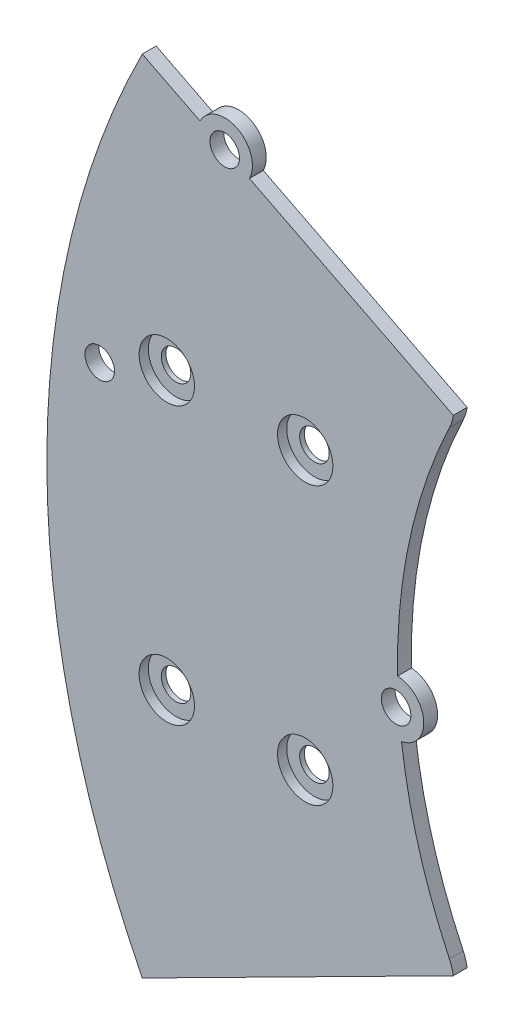
ISO-10303-21;
HEADER;
FILE_DESCRIPTION(('STEP AP214'),'2;1');
FILE_NAME('part.step','',(''),(''),'','','');
FILE_SCHEMA(('AUTOMOTIVE_DESIGN { 1 0 10303 214 1 1 1 1 }'));
ENDSEC;
DATA;
#1=APPLICATION_CONTEXT('core data for automotive mechanical design processes');
#2=APPLICATION_PROTOCOL_DEFINITION('international standard','automotive_design',2000,#1);
#3=PRODUCT_CONTEXT('',#1,'mechanical');
#4=PRODUCT('Part','Part','',(#3));
#5=PRODUCT_RELATED_PRODUCT_CATEGORY('part','',(#4));
#6=PRODUCT_DEFINITION_FORMATION('','',#4);
#7=PRODUCT_DEFINITION_CONTEXT('part definition',#1,'design');
#8=PRODUCT_DEFINITION('design','',#6,#7);
#9=PRODUCT_DEFINITION_SHAPE('','',#8);
#10=(LENGTH_UNIT() NAMED_UNIT(*) SI_UNIT(.MILLI.,.METRE.));
#11=(NAMED_UNIT(*) PLANE_ANGLE_UNIT() SI_UNIT($,.RADIAN.));
#12=(NAMED_UNIT(*) SI_UNIT($,.STERADIAN.) SOLID_ANGLE_UNIT());
#13=UNCERTAINTY_MEASURE_WITH_UNIT(LENGTH_MEASURE(1.E-05),#10,'distance_accuracy_value','');
#14=(GEOMETRIC_REPRESENTATION_CONTEXT(3) GLOBAL_UNCERTAINTY_ASSIGNED_CONTEXT((#13)) GLOBAL_UNIT_ASSIGNED_CONTEXT((#10,
#11,#12)) REPRESENTATION_CONTEXT('',''));
#15=CARTESIAN_POINT('',(0.,0.,0.));
#16=DIRECTION('',(0.,0.,1.));
#17=DIRECTION('',(1.,0.,0.));
#18=AXIS2_PLACEMENT_3D('',#15,#16,#17);
#19=CARTESIAN_POINT('',(0.,15.,1.5));
#20=DIRECTION('',(0.,0.,-1.));
#21=DIRECTION('',(-1.,0.,0.));
#22=AXIS2_PLACEMENT_3D('',#19,#20,#21);
#23=CYLINDRICAL_SURFACE('',#22,1.6);
#24=CARTESIAN_POINT('',(0.,15.,0.));
#25=DIRECTION('',(0.,0.,1.));
#26=DIRECTION('',(1.,0.,0.));
#27=AXIS2_PLACEMENT_3D('',#24,#25,#26);
#28=CIRCLE('',#27,1.6);
#29=CARTESIAN_POINT('',(1.6,15.,0.));
#30=VERTEX_POINT('',#29);
#31=EDGE_CURVE('E126',#30,#30,#28,.T.);
#32=ORIENTED_EDGE('',*,*,#31,.F.);
#33=EDGE_LOOP('',(#32));
#34=FACE_BOUND('',#33,.T.);
#35=CARTESIAN_POINT('',(0.,15.,0.5));
#36=DIRECTION('',(0.,0.,1.));
#37=DIRECTION('',(1.,0.,0.));
#38=AXIS2_PLACEMENT_3D('',#35,#36,#37);
#39=CIRCLE('',#38,1.6);
#40=CARTESIAN_POINT('',(1.6,15.,0.5));
#41=VERTEX_POINT('',#40);
#42=EDGE_CURVE('E41',#41,#41,#39,.T.);
#43=ORIENTED_EDGE('',*,*,#42,.T.);
#44=EDGE_LOOP('',(#43));
#45=FACE_BOUND('',#44,.T.);
#46=ADVANCED_FACE('F37',(#34,#45),#23,.F.);
#47=CARTESIAN_POINT('',(15.,15.,1.5));
#48=DIRECTION('',(0.,0.,-1.));
#49=DIRECTION('',(-1.,0.,0.));
#50=AXIS2_PLACEMENT_3D('',#47,#48,#49);
#51=CYLINDRICAL_SURFACE('',#50,1.6);
#52=CARTESIAN_POINT('',(15.,15.,0.));
#53=DIRECTION('',(0.,0.,1.));
#54=DIRECTION('',(1.,0.,0.));
#55=AXIS2_PLACEMENT_3D('',#52,#53,#54);
#56=CIRCLE('',#55,1.6);
#57=CARTESIAN_POINT('',(16.6,15.,0.));
#58=VERTEX_POINT('',#57);
#59=EDGE_CURVE('E192',#58,#58,#56,.T.);
#60=ORIENTED_EDGE('',*,*,#59,.F.);
#61=EDGE_LOOP('',(#60));
#62=FACE_BOUND('',#61,.T.);
#63=CARTESIAN_POINT('',(15.,15.,0.5));
#64=DIRECTION('',(0.,0.,1.));
#65=DIRECTION('',(1.,0.,0.));
#66=AXIS2_PLACEMENT_3D('',#63,#64,#65);
#67=CIRCLE('',#66,1.6);
#68=CARTESIAN_POINT('',(16.6,15.,0.5));
#69=VERTEX_POINT('',#68);
#70=EDGE_CURVE('E233',#69,#69,#67,.T.);
#71=ORIENTED_EDGE('',*,*,#70,.T.);
#72=EDGE_LOOP('',(#71));
#73=FACE_BOUND('',#72,.T.);
#74=ADVANCED_FACE('F312',(#62,#73),#51,.F.);
#75=CARTESIAN_POINT('',(15.,-15.,1.5));
#76=DIRECTION('',(0.,0.,-1.));
#77=DIRECTION('',(-1.,0.,0.));
#78=AXIS2_PLACEMENT_3D('',#75,#76,#77);
#79=CYLINDRICAL_SURFACE('',#78,1.6);
#80=CARTESIAN_POINT('',(15.,-15.,0.));
#81=DIRECTION('',(0.,0.,1.));
#82=DIRECTION('',(1.,0.,0.));
#83=AXIS2_PLACEMENT_3D('',#80,#81,#82);
#84=CIRCLE('',#83,1.6);
#85=CARTESIAN_POINT('',(16.6,-15.,0.));
#86=VERTEX_POINT('',#85);
#87=EDGE_CURVE('E189',#86,#86,#84,.T.);
#88=ORIENTED_EDGE('',*,*,#87,.F.);
#89=EDGE_LOOP('',(#88));
#90=FACE_BOUND('',#89,.T.);
#91=CARTESIAN_POINT('',(15.,-15.,0.5));
#92=DIRECTION('',(0.,0.,1.));
#93=DIRECTION('',(1.,0.,0.));
#94=AXIS2_PLACEMENT_3D('',#91,#92,#93);
#95=CIRCLE('',#94,1.6);
#96=CARTESIAN_POINT('',(16.6,-15.,0.5));
#97=VERTEX_POINT('',#96);
#98=EDGE_CURVE('E230',#97,#97,#95,.T.);
#99=ORIENTED_EDGE('',*,*,#98,.T.);
#100=EDGE_LOOP('',(#99));
#101=FACE_BOUND('',#100,.T.);
#102=ADVANCED_FACE('F319',(#90,#101),#79,.F.);
#103=CARTESIAN_POINT('',(0.,-15.,1.5));
#104=DIRECTION('',(0.,0.,-1.));
#105=DIRECTION('',(-1.,0.,0.));
#106=AXIS2_PLACEMENT_3D('',#103,#104,#105);
#107=CYLINDRICAL_SURFACE('',#106,1.6);
#108=CARTESIAN_POINT('',(0.,-15.,0.));
#109=DIRECTION('',(0.,0.,1.));
#110=DIRECTION('',(1.,0.,0.));
#111=AXIS2_PLACEMENT_3D('',#108,#109,#110);
#112=CIRCLE('',#111,1.6);
#113=CARTESIAN_POINT('',(1.6,-15.,0.));
#114=VERTEX_POINT('',#113);
#115=EDGE_CURVE('E186',#114,#114,#112,.T.);
#116=ORIENTED_EDGE('',*,*,#115,.F.);
#117=EDGE_LOOP('',(#116));
#118=FACE_BOUND('',#117,.T.);
#119=CARTESIAN_POINT('',(0.,-15.,0.5));
#120=DIRECTION('',(0.,0.,1.));
#121=DIRECTION('',(1.,0.,0.));
#122=AXIS2_PLACEMENT_3D('',#119,#120,#121);
#123=CIRCLE('',#122,1.6);
#124=CARTESIAN_POINT('',(1.6,-15.,0.5));
#125=VERTEX_POINT('',#124);
#126=EDGE_CURVE('E227',#125,#125,#123,.T.);
#127=ORIENTED_EDGE('',*,*,#126,.T.);
#128=EDGE_LOOP('',(#127));
#129=FACE_BOUND('',#128,.T.);
#130=ADVANCED_FACE('F364',(#118,#129),#107,.F.);
#131=CARTESIAN_POINT('',(83.,0.,1.5));
#132=DIRECTION('',(0.,0.,-1.));
#133=DIRECTION('',(-1.,0.,0.));
#134=AXIS2_PLACEMENT_3D('',#131,#132,#133);
#135=CYLINDRICAL_SURFACE('',#134,58.);
#136=CARTESIAN_POINT('',(83.,0.,1.5));
#137=DIRECTION('',(0.,0.,-1.));
#138=DIRECTION('',(1.,0.,0.));
#139=AXIS2_PLACEMENT_3D('',#136,#137,#138);
#140=CIRCLE('',#139,58.);
#141=CARTESIAN_POINT('',(25.012228271291,-1.19093658065189,1.5));
#142=VERTEX_POINT('',#141);
#143=CARTESIAN_POINT('',(30.6273822748281,24.9220567492535,1.5));
#144=VERTEX_POINT('',#143);
#145=EDGE_CURVE('E54',#142,#144,#140,.T.);
#146=ORIENTED_EDGE('',*,*,#145,.F.);
#147=DIRECTION('',(0.,0.,1.));
#148=VECTOR('',#147,1.);
#149=CARTESIAN_POINT('',(25.012228271291,-1.19093658065185,0.749999999999999));
#150=LINE('',#149,#148);
#151=CARTESIAN_POINT('',(25.012228271291,-1.19093658065185,0.));
#152=VERTEX_POINT('',#151);
#153=EDGE_CURVE('E128',#142,#152,#150,.F.);
#154=ORIENTED_EDGE('',*,*,#153,.T.);
#155=CARTESIAN_POINT('',(83.,0.,0.));
#156=DIRECTION('',(0.,0.,-1.));
#157=DIRECTION('',(1.,0.,0.));
#158=AXIS2_PLACEMENT_3D('',#155,#156,#157);
#159=CIRCLE('',#158,58.);
#160=CARTESIAN_POINT('',(30.6273822748281,24.9220567492535,0.));
#161=VERTEX_POINT('',#160);
#162=EDGE_CURVE('E116',#152,#161,#159,.T.);
#163=ORIENTED_EDGE('',*,*,#162,.T.);
#164=DIRECTION('',(0.,0.,-1.));
#165=VECTOR('',#164,1.);
#166=CARTESIAN_POINT('',(30.6273822748281,24.9220567492535,1.5));
#167=LINE('',#166,#165);
#168=EDGE_CURVE('E212',#161,#144,#167,.F.);
#169=ORIENTED_EDGE('',*,*,#168,.T.);
#170=EDGE_LOOP('',(#146,#154,#163,#169));
#171=FACE_BOUND('',#170,.T.);
#172=ADVANCED_FACE('F129',(#171),#135,.F.);
#173=CARTESIAN_POINT('',(83.,0.,0.));
#174=DIRECTION('',(-0.451660876345928,-0.892189695512354,0.));
#175=DIRECTION('',(0.892189695512355,-0.451660876345929,0.));
#176=AXIS2_PLACEMENT_3D('',#173,#174,#175);
#177=PLANE('',#176);
#178=DIRECTION('',(0.892189695512354,-0.451660876345929,0.));
#179=VECTOR('',#178,1.);
#180=CARTESIAN_POINT('',(83.,0.,0.));
#181=LINE('',#180,#179);
#182=CARTESIAN_POINT('',(8.95576539103195,37.4840508246903,0.));
#183=VERTEX_POINT('',#182);
#184=CARTESIAN_POINT('',(31.0524419154815,26.2978598906714,0.));
#185=VERTEX_POINT('',#184);
#186=EDGE_CURVE('E172',#183,#185,#181,.T.);
#187=ORIENTED_EDGE('',*,*,#186,.F.);
#188=DIRECTION('',(0.,0.,1.));
#189=VECTOR('',#188,1.);
#190=CARTESIAN_POINT('',(8.95576539103195,37.4840508246903,-8.48528137423857));
#191=LINE('',#190,#189);
#192=CARTESIAN_POINT('',(8.95576539103195,37.4840508246903,1.5));
#193=VERTEX_POINT('',#192);
#194=EDGE_CURVE('E145',#183,#193,#191,.T.);
#195=ORIENTED_EDGE('',*,*,#194,.T.);
#196=DIRECTION('',(0.892189695512354,-0.451660876345929,0.));
#197=VECTOR('',#196,1.);
#198=CARTESIAN_POINT('',(83.,0.,1.5));
#199=LINE('',#198,#197);
#200=CARTESIAN_POINT('',(31.0524419154815,26.2978598906714,1.5));
#201=VERTEX_POINT('',#200);
#202=EDGE_CURVE('E179',#193,#201,#199,.T.);
#203=ORIENTED_EDGE('',*,*,#202,.T.);
#204=DIRECTION('',(0.,0.,-1.));
#205=VECTOR('',#204,1.);
#206=CARTESIAN_POINT('',(31.0524419154815,26.2978598906714,1.5));
#207=LINE('',#206,#205);
#208=EDGE_CURVE('E183',#201,#185,#207,.T.);
#209=ORIENTED_EDGE('',*,*,#208,.T.);
#210=EDGE_LOOP('',(#187,#195,#203,#209));
#211=FACE_BOUND('',#210,.T.);
#212=ADVANCED_FACE('F282',(#211),#177,.F.);
#213=CARTESIAN_POINT('',(83.,0.,1.5));
#214=DIRECTION('',(0.,0.,1.));
#215=DIRECTION('',(1.,0.,0.));
#216=AXIS2_PLACEMENT_3D('',#213,#214,#215);
#217=PLANE('',#216);
#218=CARTESIAN_POINT('',(0.,-15.,1.5));
#219=DIRECTION('',(0.,0.,1.));
#220=DIRECTION('',(1.,0.,0.));
#221=AXIS2_PLACEMENT_3D('',#218,#219,#220);
#222=CIRCLE('',#221,3.);
#223=CARTESIAN_POINT('',(3.,-15.,1.5));
#224=VERTEX_POINT('',#223);
#225=EDGE_CURVE('E252',#224,#224,#222,.T.);
#226=ORIENTED_EDGE('',*,*,#225,.F.);
#227=EDGE_LOOP('',(#226));
#228=FACE_BOUND('',#227,.T.);
#229=CARTESIAN_POINT('',(15.,-15.,1.5));
#230=DIRECTION('',(0.,0.,1.));
#231=DIRECTION('',(1.,0.,0.));
#232=AXIS2_PLACEMENT_3D('',#229,#230,#231);
#233=CIRCLE('',#232,3.);
#234=CARTESIAN_POINT('',(18.,-15.,1.5));
#235=VERTEX_POINT('',#234);
#236=EDGE_CURVE('E258',#235,#235,#233,.T.);
#237=ORIENTED_EDGE('',*,*,#236,.F.);
#238=EDGE_LOOP('',(#237));
#239=FACE_BOUND('',#238,.T.);
#240=CARTESIAN_POINT('',(15.,15.,1.5));
#241=DIRECTION('',(0.,0.,1.));
#242=DIRECTION('',(1.,0.,0.));
#243=AXIS2_PLACEMENT_3D('',#240,#241,#242);
#244=CIRCLE('',#243,3.);
#245=CARTESIAN_POINT('',(18.,15.,1.5));
#246=VERTEX_POINT('',#245);
#247=EDGE_CURVE('E264',#246,#246,#244,.T.);
#248=ORIENTED_EDGE('',*,*,#247,.F.);
#249=EDGE_LOOP('',(#248));
#250=FACE_BOUND('',#249,.T.);
#251=CARTESIAN_POINT('',(0.,15.,1.5));
#252=DIRECTION('',(0.,0.,1.));
#253=DIRECTION('',(1.,0.,0.));
#254=AXIS2_PLACEMENT_3D('',#251,#252,#253);
#255=CIRCLE('',#254,3.);
#256=CARTESIAN_POINT('',(3.,15.,1.5));
#257=VERTEX_POINT('',#256);
#258=EDGE_CURVE('E140',#257,#257,#255,.T.);
#259=ORIENTED_EDGE('',*,*,#258,.F.);
#260=EDGE_LOOP('',(#259));
#261=FACE_BOUND('',#260,.T.);
#262=CARTESIAN_POINT('',(24.8481990525618,-4.18644896009598,1.5));
#263=DIRECTION('',(0.,0.,1.));
#264=DIRECTION('',(1.,0.,0.));
#265=AXIS2_PLACEMENT_3D('',#262,#263,#264);
#266=CIRCLE('',#265,3.);
#267=CARTESIAN_POINT('',(25.4396171896257,-7.12757537477996,1.5));
#268=VERTEX_POINT('',#267);
#269=EDGE_CURVE('E136',#268,#142,#266,.T.);
#270=ORIENTED_EDGE('',*,*,#269,.T.);
#271=ORIENTED_EDGE('',*,*,#145,.T.);
#272=CARTESIAN_POINT('',(26.1125014364512,27.0705099172926,1.5));
#273=DIRECTION('',(0.,0.,1.));
#274=DIRECTION('',(1.,0.,0.));
#275=AXIS2_PLACEMENT_3D('',#272,#273,#274);
#276=CIRCLE('',#275,5.);
#277=EDGE_CURVE('E216',#144,#201,#276,.T.);
#278=ORIENTED_EDGE('',*,*,#277,.T.);
#279=ORIENTED_EDGE('',*,*,#202,.F.);
#280=CARTESIAN_POINT('',(6.27919630449489,38.8390334537281,1.5));
#281=DIRECTION('',(0.,0.,1.));
#282=DIRECTION('',(1.,0.,0.));
#283=AXIS2_PLACEMENT_3D('',#280,#281,#282);
#284=CIRCLE('',#283,3.);
#285=CARTESIAN_POINT('',(3.60262721795782,40.1940160827658,1.5));
#286=VERTEX_POINT('',#285);
#287=EDGE_CURVE('E133',#193,#286,#284,.T.);
#288=ORIENTED_EDGE('',*,*,#287,.T.);
#289=CARTESIAN_POINT('',(-2.65021076918602,43.3594441292091,1.5));
#290=VERTEX_POINT('',#289);
#291=EDGE_CURVE('E173',#290,#286,#199,.T.);
#292=ORIENTED_EDGE('',*,*,#291,.F.);
#293=CARTESIAN_POINT('',(83.,0.,1.5));
#294=DIRECTION('',(0.,0.,1.));
#295=DIRECTION('',(1.,0.,0.));
#296=AXIS2_PLACEMENT_3D('',#293,#294,#295);
#297=CIRCLE('',#296,96.);
#298=CARTESIAN_POINT('',(-2.65021076918602,-43.3594441292091,1.5));
#299=VERTEX_POINT('',#298);
#300=EDGE_CURVE('E199',#290,#299,#297,.T.);
#301=ORIENTED_EDGE('',*,*,#300,.T.);
#302=DIRECTION('',(-0.892189695512354,-0.451660876345929,0.));
#303=VECTOR('',#302,1.);
#304=CARTESIAN_POINT('',(83.,0.,1.5));
#305=LINE('',#304,#303);
#306=CARTESIAN_POINT('',(31.0524419154815,-26.2978598906714,1.5));
#307=VERTEX_POINT('',#306);
#308=EDGE_CURVE('E154',#307,#299,#305,.T.);
#309=ORIENTED_EDGE('',*,*,#308,.F.);
#310=CARTESIAN_POINT('',(26.1125014364512,-27.0705099172926,1.5));
#311=DIRECTION('',(0.,0.,1.));
#312=DIRECTION('',(1.,0.,0.));
#313=AXIS2_PLACEMENT_3D('',#310,#311,#312);
#314=CIRCLE('',#313,5.);
#315=CARTESIAN_POINT('',(30.6273822748281,-24.9220567492535,1.5));
#316=VERTEX_POINT('',#315);
#317=EDGE_CURVE('E214',#307,#316,#314,.T.);
#318=ORIENTED_EDGE('',*,*,#317,.T.);
#319=EDGE_CURVE('E197',#316,#268,#140,.T.);
#320=ORIENTED_EDGE('',*,*,#319,.T.);
#321=EDGE_LOOP('',(#270,#271,#278,#279,#288,#292,#301,#309,#318,#320));
#322=FACE_BOUND('',#321,.T.);
#323=CARTESIAN_POINT('',(24.8481990525618,-4.18644896009598,1.5));
#324=DIRECTION('',(0.,0.,1.));
#325=DIRECTION('',(1.,0.,0.));
#326=AXIS2_PLACEMENT_3D('',#323,#324,#325);
#327=CIRCLE('',#326,1.6);
#328=CARTESIAN_POINT('',(26.4481990525618,-4.18644896009598,1.5));
#329=VERTEX_POINT('',#328);
#330=EDGE_CURVE('E150',#329,#329,#327,.T.);
#331=ORIENTED_EDGE('',*,*,#330,.F.);
#332=EDGE_LOOP('',(#331));
#333=FACE_BOUND('',#332,.T.);
#334=CARTESIAN_POINT('',(6.27919630449489,38.8390334537281,1.5));
#335=DIRECTION('',(0.,0.,1.));
#336=DIRECTION('',(1.,0.,0.));
#337=AXIS2_PLACEMENT_3D('',#334,#335,#336);
#338=CIRCLE('',#337,1.6);
#339=CARTESIAN_POINT('',(7.87919630449489,38.8390334537281,1.5));
#340=VERTEX_POINT('',#339);
#341=EDGE_CURVE('E161',#340,#340,#338,.T.);
#342=ORIENTED_EDGE('',*,*,#341,.F.);
#343=EDGE_LOOP('',(#342));
#344=FACE_BOUND('',#343,.T.);
#345=CARTESIAN_POINT('',(-7.27062998588297,12.0733425883574,1.5));
#346=DIRECTION('',(0.,0.,1.));
#347=DIRECTION('',(1.,0.,0.));
#348=AXIS2_PLACEMENT_3D('',#345,#346,#347);
#349=CIRCLE('',#348,1.6);
#350=CARTESIAN_POINT('',(-5.67062998588297,12.0733425883574,1.5));
#351=VERTEX_POINT('',#350);
#352=EDGE_CURVE('E155',#351,#351,#349,.T.);
#353=ORIENTED_EDGE('',*,*,#352,.F.);
#354=EDGE_LOOP('',(#353));
#355=FACE_BOUND('',#354,.T.);
#356=ADVANCED_FACE('F279',(#228,#239,#250,#261,#322,#333,#344,#355),#217,.T.);
#357=CARTESIAN_POINT('',(83.,0.,0.));
#358=DIRECTION('',(0.,0.,1.));
#359=DIRECTION('',(1.,0.,0.));
#360=AXIS2_PLACEMENT_3D('',#357,#358,#359);
#361=PLANE('',#360);
#362=ORIENTED_EDGE('',*,*,#162,.F.);
#363=CARTESIAN_POINT('',(24.8481990525618,-4.18644896009598,0.));
#364=DIRECTION('',(0.,0.,1.));
#365=DIRECTION('',(1.,0.,0.));
#366=AXIS2_PLACEMENT_3D('',#363,#364,#365);
#367=CIRCLE('',#366,3.);
#368=CARTESIAN_POINT('',(25.4396171896257,-7.12757537477996,0.));
#369=VERTEX_POINT('',#368);
#370=EDGE_CURVE('E121',#152,#369,#367,.F.);
#371=ORIENTED_EDGE('',*,*,#370,.T.);
#372=CARTESIAN_POINT('',(30.6273822748281,-24.9220567492535,0.));
#373=VERTEX_POINT('',#372);
#374=EDGE_CURVE('E125',#373,#369,#159,.T.);
#375=ORIENTED_EDGE('',*,*,#374,.F.);
#376=CARTESIAN_POINT('',(26.1125014364512,-27.0705099172926,0.));
#377=DIRECTION('',(0.,0.,1.));
#378=DIRECTION('',(1.,0.,0.));
#379=AXIS2_PLACEMENT_3D('',#376,#377,#378);
#380=CIRCLE('',#379,5.);
#381=CARTESIAN_POINT('',(31.0524419154815,-26.2978598906714,0.));
#382=VERTEX_POINT('',#381);
#383=EDGE_CURVE('E201',#373,#382,#380,.F.);
#384=ORIENTED_EDGE('',*,*,#383,.T.);
#385=DIRECTION('',(-0.892189695512354,-0.451660876345929,0.));
#386=VECTOR('',#385,1.);
#387=CARTESIAN_POINT('',(83.,0.,0.));
#388=LINE('',#387,#386);
#389=CARTESIAN_POINT('',(-2.65021076918602,-43.3594441292091,0.));
#390=VERTEX_POINT('',#389);
#391=EDGE_CURVE('E169',#382,#390,#388,.T.);
#392=ORIENTED_EDGE('',*,*,#391,.T.);
#393=CARTESIAN_POINT('',(83.,0.,0.));
#394=DIRECTION('',(0.,0.,1.));
#395=DIRECTION('',(1.,0.,0.));
#396=AXIS2_PLACEMENT_3D('',#393,#394,#395);
#397=CIRCLE('',#396,96.);
#398=CARTESIAN_POINT('',(-2.65021076918602,43.3594441292091,0.));
#399=VERTEX_POINT('',#398);
#400=EDGE_CURVE('E203',#399,#390,#397,.T.);
#401=ORIENTED_EDGE('',*,*,#400,.F.);
#402=CARTESIAN_POINT('',(3.60262721795782,40.1940160827658,0.));
#403=VERTEX_POINT('',#402);
#404=EDGE_CURVE('E174',#399,#403,#181,.T.);
#405=ORIENTED_EDGE('',*,*,#404,.T.);
#406=CARTESIAN_POINT('',(6.27919630449489,38.8390334537281,0.));
#407=DIRECTION('',(0.,0.,1.));
#408=DIRECTION('',(1.,0.,0.));
#409=AXIS2_PLACEMENT_3D('',#406,#407,#408);
#410=CIRCLE('',#409,3.);
#411=EDGE_CURVE('E143',#403,#183,#410,.F.);
#412=ORIENTED_EDGE('',*,*,#411,.T.);
#413=ORIENTED_EDGE('',*,*,#186,.T.);
#414=CARTESIAN_POINT('',(26.1125014364512,27.0705099172926,0.));
#415=DIRECTION('',(0.,0.,1.));
#416=DIRECTION('',(1.,0.,0.));
#417=AXIS2_PLACEMENT_3D('',#414,#415,#416);
#418=CIRCLE('',#417,5.);
#419=EDGE_CURVE('E123',#185,#161,#418,.F.);
#420=ORIENTED_EDGE('',*,*,#419,.T.);
#421=EDGE_LOOP('',(#362,#371,#375,#384,#392,#401,#405,#412,#413,#420));
#422=FACE_BOUND('',#421,.T.);
#423=CARTESIAN_POINT('',(24.8481990525618,-4.18644896009598,0.));
#424=DIRECTION('',(0.,0.,1.));
#425=DIRECTION('',(1.,0.,0.));
#426=AXIS2_PLACEMENT_3D('',#423,#424,#425);
#427=CIRCLE('',#426,1.6);
#428=CARTESIAN_POINT('',(26.4481990525618,-4.18644896009598,0.));
#429=VERTEX_POINT('',#428);
#430=EDGE_CURVE('E164',#429,#429,#427,.T.);
#431=ORIENTED_EDGE('',*,*,#430,.T.);
#432=EDGE_LOOP('',(#431));
#433=FACE_BOUND('',#432,.T.);
#434=CARTESIAN_POINT('',(-7.27062998588297,12.0733425883574,0.));
#435=DIRECTION('',(0.,0.,1.));
#436=DIRECTION('',(1.,0.,0.));
#437=AXIS2_PLACEMENT_3D('',#434,#435,#436);
#438=CIRCLE('',#437,1.6);
#439=CARTESIAN_POINT('',(-5.67062998588297,12.0733425883574,0.));
#440=VERTEX_POINT('',#439);
#441=EDGE_CURVE('E151',#440,#440,#438,.T.);
#442=ORIENTED_EDGE('',*,*,#441,.T.);
#443=EDGE_LOOP('',(#442));
#444=FACE_BOUND('',#443,.T.);
#445=CARTESIAN_POINT('',(6.27919630449489,38.8390334537281,0.));
#446=DIRECTION('',(0.,0.,1.));
#447=DIRECTION('',(1.,0.,0.));
#448=AXIS2_PLACEMENT_3D('',#445,#446,#447);
#449=CIRCLE('',#448,1.6);
#450=CARTESIAN_POINT('',(7.87919630449489,38.8390334537281,0.));
#451=VERTEX_POINT('',#450);
#452=EDGE_CURVE('E158',#451,#451,#449,.T.);
#453=ORIENTED_EDGE('',*,*,#452,.T.);
#454=EDGE_LOOP('',(#453));
#455=FACE_BOUND('',#454,.T.);
#456=ORIENTED_EDGE('',*,*,#31,.T.);
#457=EDGE_LOOP('',(#456));
#458=FACE_BOUND('',#457,.T.);
#459=ORIENTED_EDGE('',*,*,#59,.T.);
#460=EDGE_LOOP('',(#459));
#461=FACE_BOUND('',#460,.T.);
#462=ORIENTED_EDGE('',*,*,#87,.T.);
#463=EDGE_LOOP('',(#462));
#464=FACE_BOUND('',#463,.T.);
#465=ORIENTED_EDGE('',*,*,#115,.T.);
#466=EDGE_LOOP('',(#465));
#467=FACE_BOUND('',#466,.T.);
#468=ADVANCED_FACE('F117',(#422,#433,#444,#455,#458,#461,#464,#467),#361,.F.);
#469=ORIENTED_EDGE('',*,*,#374,.T.);
#470=DIRECTION('',(0.,0.,1.));
#471=VECTOR('',#470,1.);
#472=CARTESIAN_POINT('',(25.4396171896257,-7.12757537477996,0.749999999999999));
#473=LINE('',#472,#471);
#474=EDGE_CURVE('E11',#369,#268,#473,.T.);
#475=ORIENTED_EDGE('',*,*,#474,.T.);
#476=ORIENTED_EDGE('',*,*,#319,.F.);
#477=DIRECTION('',(0.,0.,-1.));
#478=VECTOR('',#477,1.);
#479=CARTESIAN_POINT('',(30.6273822748281,-24.9220567492535,1.5));
#480=LINE('',#479,#478);
#481=EDGE_CURVE('E209',#316,#373,#480,.T.);
#482=ORIENTED_EDGE('',*,*,#481,.T.);
#483=EDGE_LOOP('',(#469,#475,#476,#482));
#484=FACE_BOUND('',#483,.T.);
#485=ADVANCED_FACE('F327',(#484),#135,.F.);
#486=CARTESIAN_POINT('',(83.,0.,1.5));
#487=DIRECTION('',(0.,0.,-1.));
#488=DIRECTION('',(-1.,0.,0.));
#489=AXIS2_PLACEMENT_3D('',#486,#487,#488);
#490=CYLINDRICAL_SURFACE('',#489,96.);
#491=ORIENTED_EDGE('',*,*,#300,.F.);
#492=DIRECTION('',(0.,0.,-1.));
#493=VECTOR('',#492,1.);
#494=CARTESIAN_POINT('',(-2.65021076918602,43.3594441292091,1.5));
#495=LINE('',#494,#493);
#496=EDGE_CURVE('E222',#290,#399,#495,.T.);
#497=ORIENTED_EDGE('',*,*,#496,.T.);
#498=ORIENTED_EDGE('',*,*,#400,.T.);
#499=DIRECTION('',(0.,0.,-1.));
#500=VECTOR('',#499,1.);
#501=CARTESIAN_POINT('',(-2.65021076918602,-43.3594441292091,1.5));
#502=LINE('',#501,#500);
#503=EDGE_CURVE('E219',#390,#299,#502,.F.);
#504=ORIENTED_EDGE('',*,*,#503,.T.);
#505=EDGE_LOOP('',(#491,#497,#498,#504));
#506=FACE_BOUND('',#505,.T.);
#507=ADVANCED_FACE('F328',(#506),#490,.T.);
#508=CARTESIAN_POINT('',(26.1125014364512,27.0705099172926,1.5));
#509=DIRECTION('',(0.,0.,-1.));
#510=DIRECTION('',(-1.,0.,0.));
#511=AXIS2_PLACEMENT_3D('',#508,#509,#510);
#512=CYLINDRICAL_SURFACE('',#511,5.);
#513=ORIENTED_EDGE('',*,*,#208,.F.);
#514=ORIENTED_EDGE('',*,*,#277,.F.);
#515=ORIENTED_EDGE('',*,*,#168,.F.);
#516=ORIENTED_EDGE('',*,*,#419,.F.);
#517=EDGE_LOOP('',(#513,#514,#515,#516));
#518=FACE_BOUND('',#517,.T.);
#519=ADVANCED_FACE('F331',(#518),#512,.T.);
#520=CARTESIAN_POINT('',(26.1125014364512,-27.0705099172926,1.5));
#521=DIRECTION('',(0.,0.,-1.));
#522=DIRECTION('',(-1.,0.,0.));
#523=AXIS2_PLACEMENT_3D('',#520,#521,#522);
#524=CYLINDRICAL_SURFACE('',#523,5.);
#525=DIRECTION('',(0.,0.,-1.));
#526=VECTOR('',#525,1.);
#527=CARTESIAN_POINT('',(31.0524419154815,-26.2978598906714,1.5));
#528=LINE('',#527,#526);
#529=EDGE_CURVE('E177',#382,#307,#528,.F.);
#530=ORIENTED_EDGE('',*,*,#529,.F.);
#531=ORIENTED_EDGE('',*,*,#383,.F.);
#532=ORIENTED_EDGE('',*,*,#481,.F.);
#533=ORIENTED_EDGE('',*,*,#317,.F.);
#534=EDGE_LOOP('',(#530,#531,#532,#533));
#535=FACE_BOUND('',#534,.T.);
#536=ADVANCED_FACE('F39',(#535),#524,.T.);
#537=CARTESIAN_POINT('',(83.,0.,0.));
#538=DIRECTION('',(-0.451660876345928,0.892189695512354,0.));
#539=DIRECTION('',(-0.892189695512355,-0.451660876345929,0.));
#540=AXIS2_PLACEMENT_3D('',#537,#538,#539);
#541=PLANE('',#540);
#542=ORIENTED_EDGE('',*,*,#529,.T.);
#543=ORIENTED_EDGE('',*,*,#308,.T.);
#544=ORIENTED_EDGE('',*,*,#503,.F.);
#545=ORIENTED_EDGE('',*,*,#391,.F.);
#546=EDGE_LOOP('',(#542,#543,#544,#545));
#547=FACE_BOUND('',#546,.T.);
#548=ADVANCED_FACE('F339',(#547),#541,.F.);
#549=ORIENTED_EDGE('',*,*,#291,.T.);
#550=DIRECTION('',(0.,0.,1.));
#551=VECTOR('',#550,1.);
#552=CARTESIAN_POINT('',(3.60262721795782,40.1940160827659,-8.48528137423857));
#553=LINE('',#552,#551);
#554=EDGE_CURVE('E46',#286,#403,#553,.F.);
#555=ORIENTED_EDGE('',*,*,#554,.T.);
#556=ORIENTED_EDGE('',*,*,#404,.F.);
#557=ORIENTED_EDGE('',*,*,#496,.F.);
#558=EDGE_LOOP('',(#549,#555,#556,#557));
#559=FACE_BOUND('',#558,.T.);
#560=ADVANCED_FACE('F349',(#559),#177,.F.);
#561=CARTESIAN_POINT('',(6.27919630449489,38.8390334537281,0.));
#562=DIRECTION('',(0.,0.,1.));
#563=DIRECTION('',(1.,0.,0.));
#564=AXIS2_PLACEMENT_3D('',#561,#562,#563);
#565=CYLINDRICAL_SURFACE('',#564,1.6);
#566=ORIENTED_EDGE('',*,*,#341,.T.);
#567=EDGE_LOOP('',(#566));
#568=FACE_BOUND('',#567,.T.);
#569=ORIENTED_EDGE('',*,*,#452,.F.);
#570=EDGE_LOOP('',(#569));
#571=FACE_BOUND('',#570,.T.);
#572=ADVANCED_FACE('F306',(#568,#571),#565,.F.);
#573=CARTESIAN_POINT('',(24.8481990525618,-4.18644896009598,0.));
#574=DIRECTION('',(0.,0.,1.));
#575=DIRECTION('',(1.,0.,0.));
#576=AXIS2_PLACEMENT_3D('',#573,#574,#575);
#577=CYLINDRICAL_SURFACE('',#576,1.6);
#578=ORIENTED_EDGE('',*,*,#430,.F.);
#579=EDGE_LOOP('',(#578));
#580=FACE_BOUND('',#579,.T.);
#581=ORIENTED_EDGE('',*,*,#330,.T.);
#582=EDGE_LOOP('',(#581));
#583=FACE_BOUND('',#582,.T.);
#584=ADVANCED_FACE('F297',(#580,#583),#577,.F.);
#585=CARTESIAN_POINT('',(-7.27062998588297,12.0733425883574,0.));
#586=DIRECTION('',(0.,0.,1.));
#587=DIRECTION('',(1.,0.,0.));
#588=AXIS2_PLACEMENT_3D('',#585,#586,#587);
#589=CYLINDRICAL_SURFACE('',#588,1.6);
#590=ORIENTED_EDGE('',*,*,#441,.F.);
#591=EDGE_LOOP('',(#590));
#592=FACE_BOUND('',#591,.T.);
#593=ORIENTED_EDGE('',*,*,#352,.T.);
#594=EDGE_LOOP('',(#593));
#595=FACE_BOUND('',#594,.T.);
#596=ADVANCED_FACE('F294',(#592,#595),#589,.F.);
#597=CARTESIAN_POINT('',(6.27919630449489,38.8390334537281,-8.48528137423857));
#598=DIRECTION('',(0.,0.,1.));
#599=DIRECTION('',(1.,0.,0.));
#600=AXIS2_PLACEMENT_3D('',#597,#598,#599);
#601=CYLINDRICAL_SURFACE('',#600,3.);
#602=ORIENTED_EDGE('',*,*,#194,.F.);
#603=ORIENTED_EDGE('',*,*,#411,.F.);
#604=ORIENTED_EDGE('',*,*,#554,.F.);
#605=ORIENTED_EDGE('',*,*,#287,.F.);
#606=EDGE_LOOP('',(#602,#603,#604,#605));
#607=FACE_BOUND('',#606,.T.);
#608=ADVANCED_FACE('F296',(#607),#601,.T.);
#609=CARTESIAN_POINT('',(24.8481990525618,-4.18644896009598,-8.48528137423857));
#610=DIRECTION('',(0.,0.,1.));
#611=DIRECTION('',(1.,0.,0.));
#612=AXIS2_PLACEMENT_3D('',#609,#610,#611);
#613=CYLINDRICAL_SURFACE('',#612,3.);
#614=ORIENTED_EDGE('',*,*,#153,.F.);
#615=ORIENTED_EDGE('',*,*,#269,.F.);
#616=ORIENTED_EDGE('',*,*,#474,.F.);
#617=ORIENTED_EDGE('',*,*,#370,.F.);
#618=EDGE_LOOP('',(#614,#615,#616,#617));
#619=FACE_BOUND('',#618,.T.);
#620=ADVANCED_FACE('F135',(#619),#613,.T.);
#621=CARTESIAN_POINT('',(0.,-15.,0.5));
#622=DIRECTION('',(0.,0.,1.));
#623=DIRECTION('',(1.,0.,0.));
#624=AXIS2_PLACEMENT_3D('',#621,#622,#623);
#625=CYLINDRICAL_SURFACE('',#624,3.);
#626=CARTESIAN_POINT('',(0.,-15.,0.5));
#627=DIRECTION('',(0.,0.,1.));
#628=DIRECTION('',(1.,0.,0.));
#629=AXIS2_PLACEMENT_3D('',#626,#627,#628);
#630=CIRCLE('',#629,3.);
#631=CARTESIAN_POINT('',(3.,-15.,0.5));
#632=VERTEX_POINT('',#631);
#633=EDGE_CURVE('E255',#632,#632,#630,.T.);
#634=ORIENTED_EDGE('',*,*,#633,.F.);
#635=EDGE_LOOP('',(#634));
#636=FACE_BOUND('',#635,.T.);
#637=ORIENTED_EDGE('',*,*,#225,.T.);
#638=EDGE_LOOP('',(#637));
#639=FACE_BOUND('',#638,.T.);
#640=ADVANCED_FACE('F390',(#636,#639),#625,.F.);
#641=CARTESIAN_POINT('',(0.,-15.,0.5));
#642=DIRECTION('',(0.,0.,1.));
#643=DIRECTION('',(1.,0.,0.));
#644=AXIS2_PLACEMENT_3D('',#641,#642,#643);
#645=PLANE('',#644);
#646=ORIENTED_EDGE('',*,*,#126,.F.);
#647=EDGE_LOOP('',(#646));
#648=FACE_BOUND('',#647,.T.);
#649=ORIENTED_EDGE('',*,*,#633,.T.);
#650=EDGE_LOOP('',(#649));
#651=FACE_BOUND('',#650,.T.);
#652=ADVANCED_FACE('F383',(#648,#651),#645,.T.);
#653=CARTESIAN_POINT('',(15.,-15.,0.5));
#654=DIRECTION('',(0.,0.,1.));
#655=DIRECTION('',(1.,0.,0.));
#656=AXIS2_PLACEMENT_3D('',#653,#654,#655);
#657=CYLINDRICAL_SURFACE('',#656,3.);
#658=CARTESIAN_POINT('',(15.,-15.,0.5));
#659=DIRECTION('',(0.,0.,1.));
#660=DIRECTION('',(1.,0.,0.));
#661=AXIS2_PLACEMENT_3D('',#658,#659,#660);
#662=CIRCLE('',#661,3.);
#663=CARTESIAN_POINT('',(18.,-15.,0.5));
#664=VERTEX_POINT('',#663);
#665=EDGE_CURVE('E261',#664,#664,#662,.T.);
#666=ORIENTED_EDGE('',*,*,#665,.F.);
#667=EDGE_LOOP('',(#666));
#668=FACE_BOUND('',#667,.T.);
#669=ORIENTED_EDGE('',*,*,#236,.T.);
#670=EDGE_LOOP('',(#669));
#671=FACE_BOUND('',#670,.T.);
#672=ADVANCED_FACE('F377',(#668,#671),#657,.F.);
#673=CARTESIAN_POINT('',(15.,-15.,0.5));
#674=DIRECTION('',(0.,0.,1.));
#675=DIRECTION('',(1.,0.,0.));
#676=AXIS2_PLACEMENT_3D('',#673,#674,#675);
#677=PLANE('',#676);
#678=ORIENTED_EDGE('',*,*,#98,.F.);
#679=EDGE_LOOP('',(#678));
#680=FACE_BOUND('',#679,.T.);
#681=ORIENTED_EDGE('',*,*,#665,.T.);
#682=EDGE_LOOP('',(#681));
#683=FACE_BOUND('',#682,.T.);
#684=ADVANCED_FACE('F275',(#680,#683),#677,.T.);
#685=CARTESIAN_POINT('',(15.,15.,0.5));
#686=DIRECTION('',(0.,0.,1.));
#687=DIRECTION('',(1.,0.,0.));
#688=AXIS2_PLACEMENT_3D('',#685,#686,#687);
#689=CYLINDRICAL_SURFACE('',#688,3.);
#690=CARTESIAN_POINT('',(15.,15.,0.5));
#691=DIRECTION('',(0.,0.,1.));
#692=DIRECTION('',(1.,0.,0.));
#693=AXIS2_PLACEMENT_3D('',#690,#691,#692);
#694=CIRCLE('',#693,3.);
#695=CARTESIAN_POINT('',(18.,15.,0.5));
#696=VERTEX_POINT('',#695);
#697=EDGE_CURVE('E250',#696,#696,#694,.T.);
#698=ORIENTED_EDGE('',*,*,#697,.F.);
#699=EDGE_LOOP('',(#698));
#700=FACE_BOUND('',#699,.T.);
#701=ORIENTED_EDGE('',*,*,#247,.T.);
#702=EDGE_LOOP('',(#701));
#703=FACE_BOUND('',#702,.T.);
#704=ADVANCED_FACE('F272',(#700,#703),#689,.F.);
#705=CARTESIAN_POINT('',(15.,15.,0.5));
#706=DIRECTION('',(0.,0.,1.));
#707=DIRECTION('',(1.,0.,0.));
#708=AXIS2_PLACEMENT_3D('',#705,#706,#707);
#709=PLANE('',#708);
#710=ORIENTED_EDGE('',*,*,#70,.F.);
#711=EDGE_LOOP('',(#710));
#712=FACE_BOUND('',#711,.T.);
#713=ORIENTED_EDGE('',*,*,#697,.T.);
#714=EDGE_LOOP('',(#713));
#715=FACE_BOUND('',#714,.T.);
#716=ADVANCED_FACE('F270',(#712,#715),#709,.T.);
#717=CARTESIAN_POINT('',(0.,15.,0.5));
#718=DIRECTION('',(0.,0.,1.));
#719=DIRECTION('',(1.,0.,0.));
#720=AXIS2_PLACEMENT_3D('',#717,#718,#719);
#721=CYLINDRICAL_SURFACE('',#720,3.);
#722=CARTESIAN_POINT('',(0.,15.,0.5));
#723=DIRECTION('',(0.,0.,1.));
#724=DIRECTION('',(1.,0.,0.));
#725=AXIS2_PLACEMENT_3D('',#722,#723,#724);
#726=CIRCLE('',#725,3.);
#727=CARTESIAN_POINT('',(3.,15.,0.5));
#728=VERTEX_POINT('',#727);
#729=EDGE_CURVE('E231',#728,#728,#726,.T.);
#730=ORIENTED_EDGE('',*,*,#729,.F.);
#731=EDGE_LOOP('',(#730));
#732=FACE_BOUND('',#731,.T.);
#733=ORIENTED_EDGE('',*,*,#258,.T.);
#734=EDGE_LOOP('',(#733));
#735=FACE_BOUND('',#734,.T.);
#736=ADVANCED_FACE('F244',(#732,#735),#721,.F.);
#737=CARTESIAN_POINT('',(0.,15.,0.5));
#738=DIRECTION('',(0.,0.,1.));
#739=DIRECTION('',(1.,0.,0.));
#740=AXIS2_PLACEMENT_3D('',#737,#738,#739);
#741=PLANE('',#740);
#742=ORIENTED_EDGE('',*,*,#42,.F.);
#743=EDGE_LOOP('',(#742));
#744=FACE_BOUND('',#743,.T.);
#745=ORIENTED_EDGE('',*,*,#729,.T.);
#746=EDGE_LOOP('',(#745));
#747=FACE_BOUND('',#746,.T.);
#748=ADVANCED_FACE('F241',(#744,#747),#741,.T.);
#749=CLOSED_SHELL('',(#46,#74,#102,#130,#172,#212,#356,#468,#485,#507,#519,#536,#548,#560,#572,
#584,#596,#608,#620,#640,#652,#672,#684,#704,#716,#736,#748));
#750=MANIFOLD_SOLID_BREP('B2',#749);
#751=ADVANCED_BREP_SHAPE_REPRESENTATION('',(#18,#750),#14);
#752=SHAPE_DEFINITION_REPRESENTATION(#9,#751);
ENDSEC;
END-ISO-10303-21;
